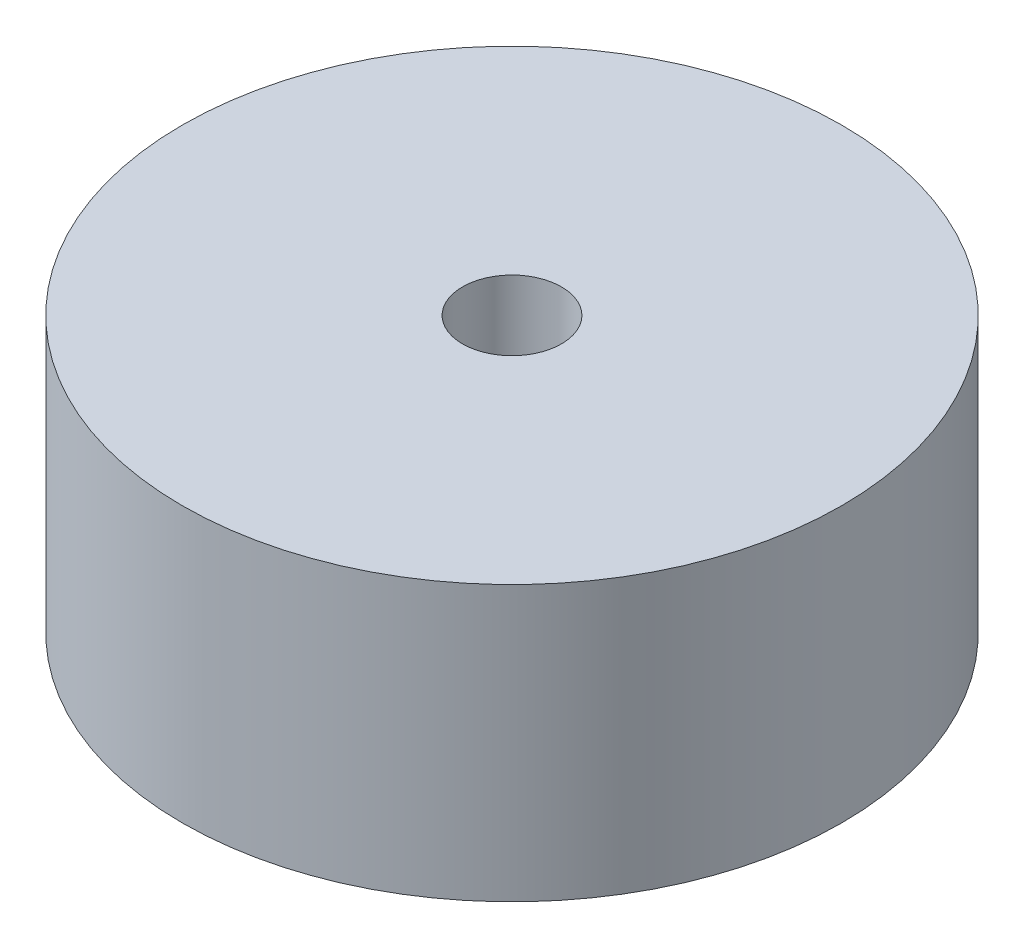
ISO-10303-21;
HEADER;
FILE_DESCRIPTION(('STEP AP214'),'2;1');
FILE_NAME('part.step','',(''),(''),'','','');
FILE_SCHEMA(('AUTOMOTIVE_DESIGN { 1 0 10303 214 1 1 1 1 }'));
ENDSEC;
DATA;
#1=APPLICATION_CONTEXT('core data for automotive mechanical design processes');
#2=APPLICATION_PROTOCOL_DEFINITION('international standard','automotive_design',2000,#1);
#3=PRODUCT_CONTEXT('',#1,'mechanical');
#4=PRODUCT('Part','Part','',(#3));
#5=PRODUCT_RELATED_PRODUCT_CATEGORY('part','',(#4));
#6=PRODUCT_DEFINITION_FORMATION('','',#4);
#7=PRODUCT_DEFINITION_CONTEXT('part definition',#1,'design');
#8=PRODUCT_DEFINITION('design','',#6,#7);
#9=PRODUCT_DEFINITION_SHAPE('','',#8);
#10=(LENGTH_UNIT() NAMED_UNIT(*) SI_UNIT(.MILLI.,.METRE.));
#11=(NAMED_UNIT(*) PLANE_ANGLE_UNIT() SI_UNIT($,.RADIAN.));
#12=(NAMED_UNIT(*) SI_UNIT($,.STERADIAN.) SOLID_ANGLE_UNIT());
#13=UNCERTAINTY_MEASURE_WITH_UNIT(LENGTH_MEASURE(1.E-05),#10,'distance_accuracy_value','');
#14=(GEOMETRIC_REPRESENTATION_CONTEXT(3) GLOBAL_UNCERTAINTY_ASSIGNED_CONTEXT((#13)) GLOBAL_UNIT_ASSIGNED_CONTEXT((#10,
#11,#12)) REPRESENTATION_CONTEXT('',''));
#15=CARTESIAN_POINT('',(0.,0.,0.));
#16=DIRECTION('',(0.,0.,1.));
#17=DIRECTION('',(1.,0.,0.));
#18=AXIS2_PLACEMENT_3D('',#15,#16,#17);
#19=CARTESIAN_POINT('',(0.,50.,0.));
#20=DIRECTION('',(0.,1.,0.));
#21=DIRECTION('',(0.,0.,1.));
#22=AXIS2_PLACEMENT_3D('',#19,#20,#21);
#23=PLANE('',#22);
#24=CARTESIAN_POINT('',(0.,50.,0.));
#25=DIRECTION('',(0.,1.,0.));
#26=DIRECTION('',(0.,0.,1.));
#27=AXIS2_PLACEMENT_3D('',#24,#25,#26);
#28=CIRCLE('',#27,60.);
#29=CARTESIAN_POINT('',(0.,50.,60.));
#30=VERTEX_POINT('',#29);
#31=EDGE_CURVE('E10',#30,#30,#28,.T.);
#32=ORIENTED_EDGE('',*,*,#31,.T.);
#33=EDGE_LOOP('',(#32));
#34=FACE_BOUND('',#33,.T.);
#35=CARTESIAN_POINT('',(0.,50.,0.));
#36=DIRECTION('',(0.,1.,0.));
#37=DIRECTION('',(0.,0.,1.));
#38=AXIS2_PLACEMENT_3D('',#35,#36,#37);
#39=CIRCLE('',#38,9.);
#40=CARTESIAN_POINT('',(0.,50.,9.));
#41=VERTEX_POINT('',#40);
#42=EDGE_CURVE('E42',#41,#41,#39,.T.);
#43=ORIENTED_EDGE('',*,*,#42,.F.);
#44=EDGE_LOOP('',(#43));
#45=FACE_BOUND('',#44,.T.);
#46=ADVANCED_FACE('F31',(#34,#45),#23,.T.);
#47=CARTESIAN_POINT('',(0.,0.,0.));
#48=DIRECTION('',(0.,1.,0.));
#49=DIRECTION('',(0.,0.,1.));
#50=AXIS2_PLACEMENT_3D('',#47,#48,#49);
#51=PLANE('',#50);
#52=CARTESIAN_POINT('',(0.,0.,0.));
#53=DIRECTION('',(0.,1.,0.));
#54=DIRECTION('',(0.,0.,1.));
#55=AXIS2_PLACEMENT_3D('',#52,#53,#54);
#56=CIRCLE('',#55,60.);
#57=CARTESIAN_POINT('',(0.,0.,60.));
#58=VERTEX_POINT('',#57);
#59=EDGE_CURVE('E35',#58,#58,#56,.T.);
#60=ORIENTED_EDGE('',*,*,#59,.F.);
#61=EDGE_LOOP('',(#60));
#62=FACE_BOUND('',#61,.T.);
#63=CARTESIAN_POINT('',(0.,0.,0.));
#64=DIRECTION('',(0.,1.,0.));
#65=DIRECTION('',(0.,0.,1.));
#66=AXIS2_PLACEMENT_3D('',#63,#64,#65);
#67=CIRCLE('',#66,9.);
#68=CARTESIAN_POINT('',(0.,0.,9.));
#69=VERTEX_POINT('',#68);
#70=EDGE_CURVE('E44',#69,#69,#67,.T.);
#71=ORIENTED_EDGE('',*,*,#70,.T.);
#72=EDGE_LOOP('',(#71));
#73=FACE_BOUND('',#72,.T.);
#74=ADVANCED_FACE('F54',(#62,#73),#51,.F.);
#75=CARTESIAN_POINT('',(0.,50.,0.));
#76=DIRECTION('',(0.,-1.,0.));
#77=DIRECTION('',(0.,0.,-1.));
#78=AXIS2_PLACEMENT_3D('',#75,#76,#77);
#79=CYLINDRICAL_SURFACE('',#78,60.);
#80=ORIENTED_EDGE('',*,*,#31,.F.);
#81=EDGE_LOOP('',(#80));
#82=FACE_BOUND('',#81,.T.);
#83=ORIENTED_EDGE('',*,*,#59,.T.);
#84=EDGE_LOOP('',(#83));
#85=FACE_BOUND('',#84,.T.);
#86=ADVANCED_FACE('F33',(#82,#85),#79,.T.);
#87=CARTESIAN_POINT('',(0.,50.,0.));
#88=DIRECTION('',(0.,-1.,0.));
#89=DIRECTION('',(0.,0.,-1.));
#90=AXIS2_PLACEMENT_3D('',#87,#88,#89);
#91=CYLINDRICAL_SURFACE('',#90,9.);
#92=ORIENTED_EDGE('',*,*,#42,.T.);
#93=EDGE_LOOP('',(#92));
#94=FACE_BOUND('',#93,.T.);
#95=ORIENTED_EDGE('',*,*,#70,.F.);
#96=EDGE_LOOP('',(#95));
#97=FACE_BOUND('',#96,.T.);
#98=ADVANCED_FACE('F50',(#94,#97),#91,.F.);
#99=CLOSED_SHELL('',(#46,#74,#86,#98));
#100=MANIFOLD_SOLID_BREP('B2',#99);
#101=ADVANCED_BREP_SHAPE_REPRESENTATION('',(#18,#100),#14);
#102=SHAPE_DEFINITION_REPRESENTATION(#9,#101);
ENDSEC;
END-ISO-10303-21;
